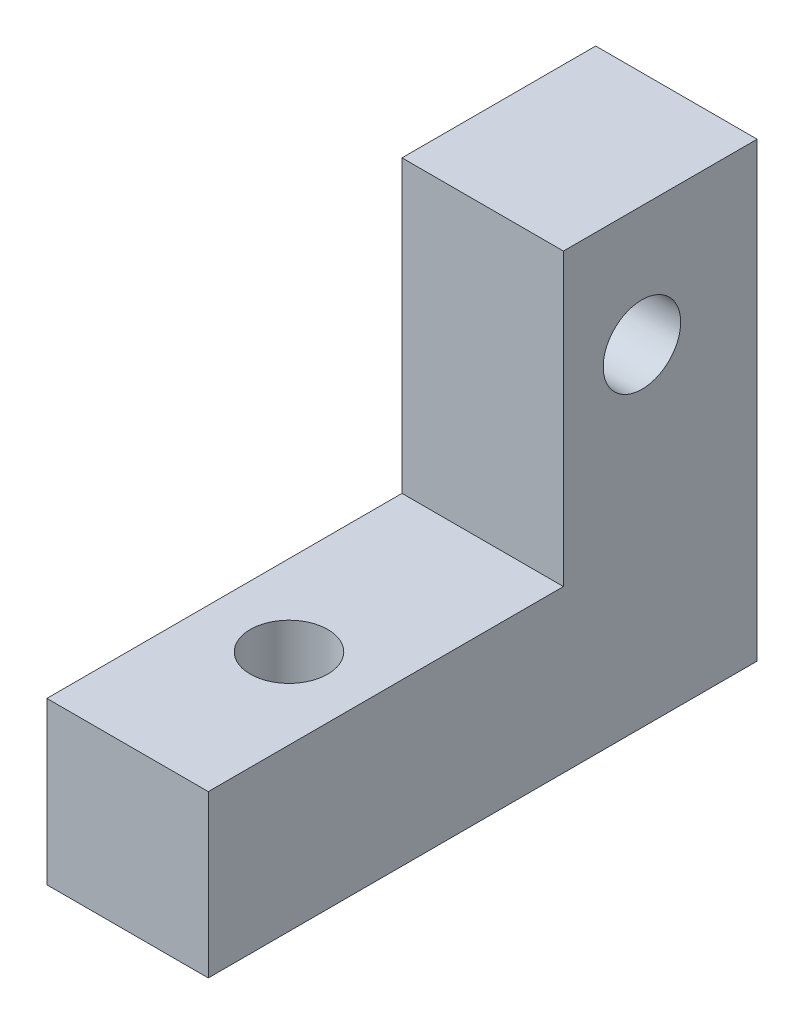
ISO-10303-21;
HEADER;
FILE_DESCRIPTION(('STEP AP214'),'2;1');
FILE_NAME('part.step','',(''),(''),'','','');
FILE_SCHEMA(('AUTOMOTIVE_DESIGN { 1 0 10303 214 1 1 1 1 }'));
ENDSEC;
DATA;
#1=APPLICATION_CONTEXT('core data for automotive mechanical design processes');
#2=APPLICATION_PROTOCOL_DEFINITION('international standard','automotive_design',2000,#1);
#3=PRODUCT_CONTEXT('',#1,'mechanical');
#4=PRODUCT('Part','Part','',(#3));
#5=PRODUCT_RELATED_PRODUCT_CATEGORY('part','',(#4));
#6=PRODUCT_DEFINITION_FORMATION('','',#4);
#7=PRODUCT_DEFINITION_CONTEXT('part definition',#1,'design');
#8=PRODUCT_DEFINITION('design','',#6,#7);
#9=PRODUCT_DEFINITION_SHAPE('','',#8);
#10=(LENGTH_UNIT() NAMED_UNIT(*) SI_UNIT(.MILLI.,.METRE.));
#11=(NAMED_UNIT(*) PLANE_ANGLE_UNIT() SI_UNIT($,.RADIAN.));
#12=(NAMED_UNIT(*) SI_UNIT($,.STERADIAN.) SOLID_ANGLE_UNIT());
#13=UNCERTAINTY_MEASURE_WITH_UNIT(LENGTH_MEASURE(1.E-05),#10,'distance_accuracy_value','');
#14=(GEOMETRIC_REPRESENTATION_CONTEXT(3) GLOBAL_UNCERTAINTY_ASSIGNED_CONTEXT((#13)) GLOBAL_UNIT_ASSIGNED_CONTEXT((#10,
#11,#12)) REPRESENTATION_CONTEXT('',''));
#15=CARTESIAN_POINT('',(0.,0.,0.));
#16=DIRECTION('',(0.,0.,1.));
#17=DIRECTION('',(1.,0.,0.));
#18=AXIS2_PLACEMENT_3D('',#15,#16,#17);
#19=CARTESIAN_POINT('',(6.35,0.,0.));
#20=DIRECTION('',(0.,1.,0.));
#21=DIRECTION('',(0.,0.,1.));
#22=AXIS2_PLACEMENT_3D('',#19,#20,#21);
#23=PLANE('',#22);
#24=CARTESIAN_POINT('',(3.175,0.,-6.35));
#25=DIRECTION('',(0.,1.,0.));
#26=DIRECTION('',(0.,0.,1.));
#27=AXIS2_PLACEMENT_3D('',#24,#25,#26);
#28=CIRCLE('',#27,1.524);
#29=CARTESIAN_POINT('',(3.175,0.,-4.826));
#30=VERTEX_POINT('',#29);
#31=EDGE_CURVE('E139',#30,#30,#28,.T.);
#32=ORIENTED_EDGE('',*,*,#31,.T.);
#33=EDGE_LOOP('',(#32));
#34=FACE_BOUND('',#33,.T.);
#35=DIRECTION('',(0.,0.,-1.));
#36=VECTOR('',#35,1.);
#37=CARTESIAN_POINT('',(0.,0.,0.));
#38=LINE('',#37,#36);
#39=CARTESIAN_POINT('',(0.,0.,0.));
#40=VERTEX_POINT('',#39);
#41=CARTESIAN_POINT('',(0.,0.,-21.59));
#42=VERTEX_POINT('',#41);
#43=EDGE_CURVE('E134',#40,#42,#38,.T.);
#44=ORIENTED_EDGE('',*,*,#43,.T.);
#45=DIRECTION('',(-1.,0.,0.));
#46=VECTOR('',#45,1.);
#47=CARTESIAN_POINT('',(6.35,0.,-21.59));
#48=LINE('',#47,#46);
#49=CARTESIAN_POINT('',(6.35,0.,-21.59));
#50=VERTEX_POINT('',#49);
#51=EDGE_CURVE('E11',#50,#42,#48,.T.);
#52=ORIENTED_EDGE('',*,*,#51,.F.);
#53=DIRECTION('',(0.,0.,-1.));
#54=VECTOR('',#53,1.);
#55=CARTESIAN_POINT('',(6.35,0.,0.));
#56=LINE('',#55,#54);
#57=CARTESIAN_POINT('',(6.35,0.,0.));
#58=VERTEX_POINT('',#57);
#59=EDGE_CURVE('E151',#58,#50,#56,.T.);
#60=ORIENTED_EDGE('',*,*,#59,.F.);
#61=DIRECTION('',(-1.,0.,0.));
#62=VECTOR('',#61,1.);
#63=CARTESIAN_POINT('',(6.35,0.,0.));
#64=LINE('',#63,#62);
#65=EDGE_CURVE('E130',#58,#40,#64,.T.);
#66=ORIENTED_EDGE('',*,*,#65,.T.);
#67=EDGE_LOOP('',(#44,#52,#60,#66));
#68=FACE_BOUND('',#67,.T.);
#69=ADVANCED_FACE('F45',(#34,#68),#23,.F.);
#70=CARTESIAN_POINT('',(6.35,0.,-21.59));
#71=DIRECTION('',(0.,0.,1.));
#72=DIRECTION('',(1.,0.,0.));
#73=AXIS2_PLACEMENT_3D('',#70,#71,#72);
#74=PLANE('',#73);
#75=DIRECTION('',(0.,1.,0.));
#76=VECTOR('',#75,1.);
#77=CARTESIAN_POINT('',(0.,0.,-21.59));
#78=LINE('',#77,#76);
#79=CARTESIAN_POINT('',(0.,17.78,-21.59));
#80=VERTEX_POINT('',#79);
#81=EDGE_CURVE('E138',#42,#80,#78,.T.);
#82=ORIENTED_EDGE('',*,*,#81,.T.);
#83=DIRECTION('',(-1.,0.,0.));
#84=VECTOR('',#83,1.);
#85=CARTESIAN_POINT('',(6.35,17.78,-21.59));
#86=LINE('',#85,#84);
#87=CARTESIAN_POINT('',(6.35,17.78,-21.59));
#88=VERTEX_POINT('',#87);
#89=EDGE_CURVE('E54',#88,#80,#86,.T.);
#90=ORIENTED_EDGE('',*,*,#89,.F.);
#91=DIRECTION('',(0.,1.,0.));
#92=VECTOR('',#91,1.);
#93=CARTESIAN_POINT('',(6.35,0.,-21.59));
#94=LINE('',#93,#92);
#95=EDGE_CURVE('E99',#50,#88,#94,.T.);
#96=ORIENTED_EDGE('',*,*,#95,.F.);
#97=ORIENTED_EDGE('',*,*,#51,.T.);
#98=EDGE_LOOP('',(#82,#90,#96,#97));
#99=FACE_BOUND('',#98,.T.);
#100=ADVANCED_FACE('F182',(#99),#74,.F.);
#101=CARTESIAN_POINT('',(6.35,17.78,-21.59));
#102=DIRECTION('',(0.,-1.,0.));
#103=DIRECTION('',(0.,0.,-1.));
#104=AXIS2_PLACEMENT_3D('',#101,#102,#103);
#105=PLANE('',#104);
#106=DIRECTION('',(0.,0.,1.));
#107=VECTOR('',#106,1.);
#108=CARTESIAN_POINT('',(0.,17.78,-21.59));
#109=LINE('',#108,#107);
#110=CARTESIAN_POINT('',(0.,17.78,-13.97));
#111=VERTEX_POINT('',#110);
#112=EDGE_CURVE('E142',#80,#111,#109,.T.);
#113=ORIENTED_EDGE('',*,*,#112,.T.);
#114=DIRECTION('',(-1.,0.,0.));
#115=VECTOR('',#114,1.);
#116=CARTESIAN_POINT('',(6.35,17.78,-13.97));
#117=LINE('',#116,#115);
#118=CARTESIAN_POINT('',(6.35,17.78,-13.97));
#119=VERTEX_POINT('',#118);
#120=EDGE_CURVE('E123',#119,#111,#117,.T.);
#121=ORIENTED_EDGE('',*,*,#120,.F.);
#122=DIRECTION('',(0.,0.,1.));
#123=VECTOR('',#122,1.);
#124=CARTESIAN_POINT('',(6.35,17.78,-21.59));
#125=LINE('',#124,#123);
#126=EDGE_CURVE('E112',#88,#119,#125,.T.);
#127=ORIENTED_EDGE('',*,*,#126,.F.);
#128=ORIENTED_EDGE('',*,*,#89,.T.);
#129=EDGE_LOOP('',(#113,#121,#127,#128));
#130=FACE_BOUND('',#129,.T.);
#131=ADVANCED_FACE('F161',(#130),#105,.F.);
#132=CARTESIAN_POINT('',(6.35,17.78,-13.97));
#133=DIRECTION('',(0.,0.,-1.));
#134=DIRECTION('',(0.,1.,0.));
#135=AXIS2_PLACEMENT_3D('',#132,#133,#134);
#136=PLANE('',#135);
#137=DIRECTION('',(0.,-1.,0.));
#138=VECTOR('',#137,1.);
#139=CARTESIAN_POINT('',(0.,17.78,-13.97));
#140=LINE('',#139,#138);
#141=CARTESIAN_POINT('',(0.,6.35,-13.97));
#142=VERTEX_POINT('',#141);
#143=EDGE_CURVE('E121',#111,#142,#140,.T.);
#144=ORIENTED_EDGE('',*,*,#143,.T.);
#145=DIRECTION('',(-1.,0.,0.));
#146=VECTOR('',#145,1.);
#147=CARTESIAN_POINT('',(6.35,6.35,-13.97));
#148=LINE('',#147,#146);
#149=CARTESIAN_POINT('',(6.35,6.35,-13.97));
#150=VERTEX_POINT('',#149);
#151=EDGE_CURVE('E118',#150,#142,#148,.T.);
#152=ORIENTED_EDGE('',*,*,#151,.F.);
#153=DIRECTION('',(0.,-1.,0.));
#154=VECTOR('',#153,1.);
#155=CARTESIAN_POINT('',(6.35,17.78,-13.97));
#156=LINE('',#155,#154);
#157=EDGE_CURVE('E106',#119,#150,#156,.T.);
#158=ORIENTED_EDGE('',*,*,#157,.F.);
#159=ORIENTED_EDGE('',*,*,#120,.T.);
#160=EDGE_LOOP('',(#144,#152,#158,#159));
#161=FACE_BOUND('',#160,.T.);
#162=ADVANCED_FACE('F119',(#161),#136,.F.);
#163=CARTESIAN_POINT('',(6.35,6.35,0.));
#164=DIRECTION('',(0.,-1.,0.));
#165=DIRECTION('',(0.,0.,-1.));
#166=AXIS2_PLACEMENT_3D('',#163,#164,#165);
#167=PLANE('',#166);
#168=CARTESIAN_POINT('',(3.175,6.35,-6.35));
#169=DIRECTION('',(0.,1.,0.));
#170=DIRECTION('',(0.,0.,1.));
#171=AXIS2_PLACEMENT_3D('',#168,#169,#170);
#172=CIRCLE('',#171,1.524);
#173=CARTESIAN_POINT('',(3.175,6.35,-4.826));
#174=VERTEX_POINT('',#173);
#175=EDGE_CURVE('E191',#174,#174,#172,.T.);
#176=ORIENTED_EDGE('',*,*,#175,.F.);
#177=EDGE_LOOP('',(#176));
#178=FACE_BOUND('',#177,.T.);
#179=DIRECTION('',(0.,0.,1.));
#180=VECTOR('',#179,1.);
#181=CARTESIAN_POINT('',(0.,6.35,0.));
#182=LINE('',#181,#180);
#183=CARTESIAN_POINT('',(0.,6.35,0.));
#184=VERTEX_POINT('',#183);
#185=EDGE_CURVE('E85',#142,#184,#182,.T.);
#186=ORIENTED_EDGE('',*,*,#185,.T.);
#187=DIRECTION('',(-1.,0.,0.));
#188=VECTOR('',#187,1.);
#189=CARTESIAN_POINT('',(6.35,6.35,0.));
#190=LINE('',#189,#188);
#191=CARTESIAN_POINT('',(6.35,6.35,0.));
#192=VERTEX_POINT('',#191);
#193=EDGE_CURVE('E124',#192,#184,#190,.T.);
#194=ORIENTED_EDGE('',*,*,#193,.F.);
#195=DIRECTION('',(0.,0.,1.));
#196=VECTOR('',#195,1.);
#197=CARTESIAN_POINT('',(6.35,6.35,0.));
#198=LINE('',#197,#196);
#199=EDGE_CURVE('E110',#150,#192,#198,.T.);
#200=ORIENTED_EDGE('',*,*,#199,.F.);
#201=ORIENTED_EDGE('',*,*,#151,.T.);
#202=EDGE_LOOP('',(#186,#194,#200,#201));
#203=FACE_BOUND('',#202,.T.);
#204=ADVANCED_FACE('F126',(#178,#203),#167,.F.);
#205=CARTESIAN_POINT('',(6.35,0.,0.));
#206=DIRECTION('',(0.,0.,-1.));
#207=DIRECTION('',(-1.,0.,0.));
#208=AXIS2_PLACEMENT_3D('',#205,#206,#207);
#209=PLANE('',#208);
#210=DIRECTION('',(0.,-1.,0.));
#211=VECTOR('',#210,1.);
#212=CARTESIAN_POINT('',(0.,0.,0.));
#213=LINE('',#212,#211);
#214=EDGE_CURVE('E91',#184,#40,#213,.T.);
#215=ORIENTED_EDGE('',*,*,#214,.T.);
#216=ORIENTED_EDGE('',*,*,#65,.F.);
#217=DIRECTION('',(0.,-1.,0.));
#218=VECTOR('',#217,1.);
#219=CARTESIAN_POINT('',(6.35,0.,0.));
#220=LINE('',#219,#218);
#221=EDGE_CURVE('E62',#192,#58,#220,.T.);
#222=ORIENTED_EDGE('',*,*,#221,.F.);
#223=ORIENTED_EDGE('',*,*,#193,.T.);
#224=EDGE_LOOP('',(#215,#216,#222,#223));
#225=FACE_BOUND('',#224,.T.);
#226=ADVANCED_FACE('F168',(#225),#209,.F.);
#227=CARTESIAN_POINT('',(6.35,0.,0.));
#228=DIRECTION('',(1.,0.,0.));
#229=DIRECTION('',(0.,0.,-1.));
#230=AXIS2_PLACEMENT_3D('',#227,#228,#229);
#231=PLANE('',#230);
#232=CARTESIAN_POINT('',(6.35,13.051566734,-17.057623492));
#233=DIRECTION('',(1.,0.,0.));
#234=DIRECTION('',(0.,0.,-1.));
#235=AXIS2_PLACEMENT_3D('',#232,#233,#234);
#236=CIRCLE('',#235,1.524);
#237=CARTESIAN_POINT('',(6.35,13.051566734,-18.581623492));
#238=VERTEX_POINT('',#237);
#239=EDGE_CURVE('E198',#238,#238,#236,.T.);
#240=ORIENTED_EDGE('',*,*,#239,.F.);
#241=EDGE_LOOP('',(#240));
#242=FACE_BOUND('',#241,.T.);
#243=ORIENTED_EDGE('',*,*,#59,.T.);
#244=ORIENTED_EDGE('',*,*,#95,.T.);
#245=ORIENTED_EDGE('',*,*,#126,.T.);
#246=ORIENTED_EDGE('',*,*,#157,.T.);
#247=ORIENTED_EDGE('',*,*,#199,.T.);
#248=ORIENTED_EDGE('',*,*,#221,.T.);
#249=EDGE_LOOP('',(#243,#244,#245,#246,#247,#248));
#250=FACE_BOUND('',#249,.T.);
#251=ADVANCED_FACE('F108',(#242,#250),#231,.T.);
#252=CARTESIAN_POINT('',(0.,0.,0.));
#253=DIRECTION('',(1.,0.,0.));
#254=DIRECTION('',(0.,0.,-1.));
#255=AXIS2_PLACEMENT_3D('',#252,#253,#254);
#256=PLANE('',#255);
#257=CARTESIAN_POINT('',(0.,13.051566734,-17.057623492));
#258=DIRECTION('',(1.,0.,0.));
#259=DIRECTION('',(0.,0.,-1.));
#260=AXIS2_PLACEMENT_3D('',#257,#258,#259);
#261=CIRCLE('',#260,1.524);
#262=CARTESIAN_POINT('',(0.,13.051566734,-18.581623492));
#263=VERTEX_POINT('',#262);
#264=EDGE_CURVE('E195',#263,#263,#261,.T.);
#265=ORIENTED_EDGE('',*,*,#264,.T.);
#266=EDGE_LOOP('',(#265));
#267=FACE_BOUND('',#266,.T.);
#268=ORIENTED_EDGE('',*,*,#43,.F.);
#269=ORIENTED_EDGE('',*,*,#214,.F.);
#270=ORIENTED_EDGE('',*,*,#185,.F.);
#271=ORIENTED_EDGE('',*,*,#143,.F.);
#272=ORIENTED_EDGE('',*,*,#112,.F.);
#273=ORIENTED_EDGE('',*,*,#81,.F.);
#274=EDGE_LOOP('',(#268,#269,#270,#271,#272,#273));
#275=FACE_BOUND('',#274,.T.);
#276=ADVANCED_FACE('F164',(#267,#275),#256,.F.);
#277=CARTESIAN_POINT('',(3.175,0.,-6.35));
#278=DIRECTION('',(0.,1.,0.));
#279=DIRECTION('',(0.,0.,1.));
#280=AXIS2_PLACEMENT_3D('',#277,#278,#279);
#281=CYLINDRICAL_SURFACE('',#280,1.524);
#282=ORIENTED_EDGE('',*,*,#31,.F.);
#283=EDGE_LOOP('',(#282));
#284=FACE_BOUND('',#283,.T.);
#285=ORIENTED_EDGE('',*,*,#175,.T.);
#286=EDGE_LOOP('',(#285));
#287=FACE_BOUND('',#286,.T.);
#288=ADVANCED_FACE('F215',(#284,#287),#281,.F.);
#289=CARTESIAN_POINT('',(0.,13.051566734,-17.057623492));
#290=DIRECTION('',(1.,0.,0.));
#291=DIRECTION('',(0.,0.,-1.));
#292=AXIS2_PLACEMENT_3D('',#289,#290,#291);
#293=CYLINDRICAL_SURFACE('',#292,1.524);
#294=ORIENTED_EDGE('',*,*,#264,.F.);
#295=EDGE_LOOP('',(#294));
#296=FACE_BOUND('',#295,.T.);
#297=ORIENTED_EDGE('',*,*,#239,.T.);
#298=EDGE_LOOP('',(#297));
#299=FACE_BOUND('',#298,.T.);
#300=ADVANCED_FACE('F212',(#296,#299),#293,.F.);
#301=CLOSED_SHELL('',(#69,#100,#131,#162,#204,#226,#251,#276,#288,#300));
#302=MANIFOLD_SOLID_BREP('B2',#301);
#303=ADVANCED_BREP_SHAPE_REPRESENTATION('',(#18,#302),#14);
#304=SHAPE_DEFINITION_REPRESENTATION(#9,#303);
ENDSEC;
END-ISO-10303-21;
